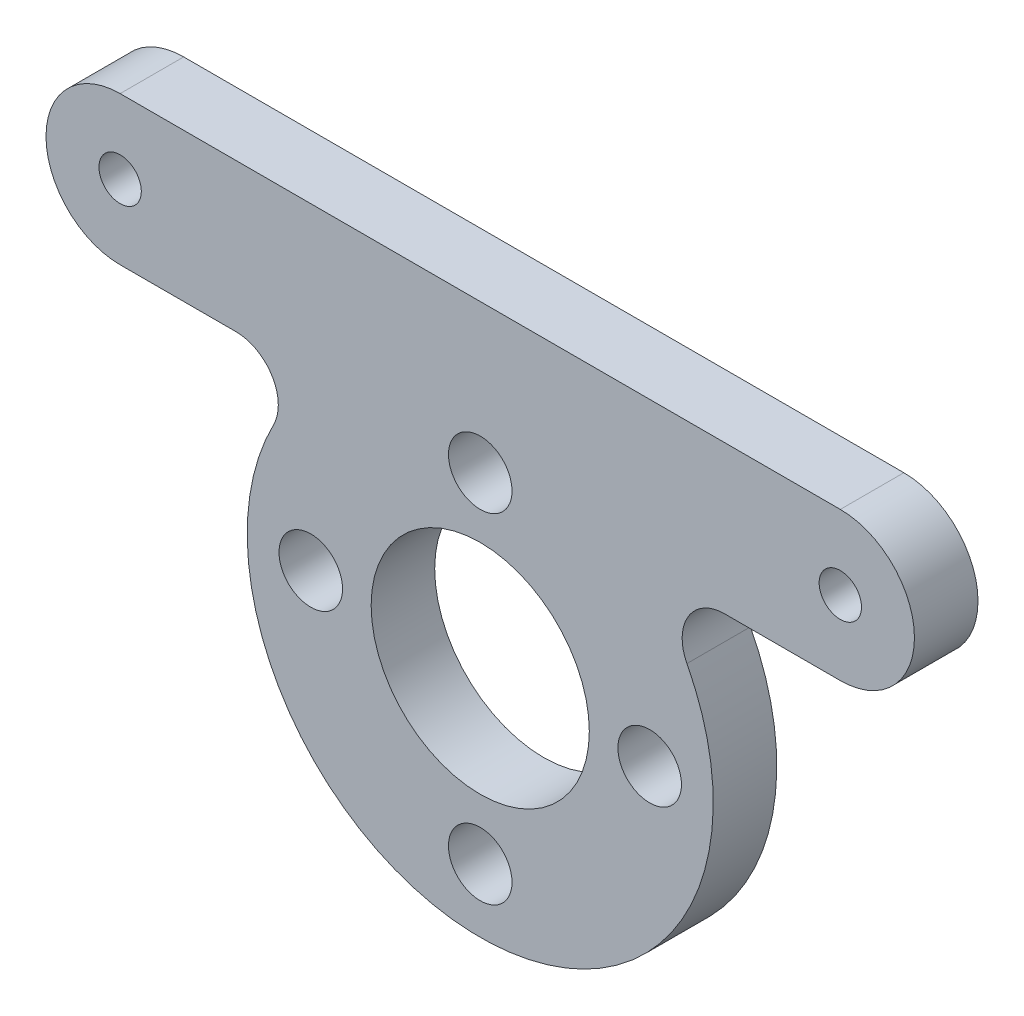
ISO-10303-21;
HEADER;
FILE_DESCRIPTION(('STEP AP214'),'2;1');
FILE_NAME('part.step','',(''),(''),'','','');
FILE_SCHEMA(('AUTOMOTIVE_DESIGN { 1 0 10303 214 1 1 1 1 }'));
ENDSEC;
DATA;
#1=APPLICATION_CONTEXT('core data for automotive mechanical design processes');
#2=APPLICATION_PROTOCOL_DEFINITION('international standard','automotive_design',2000,#1);
#3=PRODUCT_CONTEXT('',#1,'mechanical');
#4=PRODUCT('Part','Part','',(#3));
#5=PRODUCT_RELATED_PRODUCT_CATEGORY('part','',(#4));
#6=PRODUCT_DEFINITION_FORMATION('','',#4);
#7=PRODUCT_DEFINITION_CONTEXT('part definition',#1,'design');
#8=PRODUCT_DEFINITION('design','',#6,#7);
#9=PRODUCT_DEFINITION_SHAPE('','',#8);
#10=(LENGTH_UNIT() NAMED_UNIT(*) SI_UNIT(.MILLI.,.METRE.));
#11=(NAMED_UNIT(*) PLANE_ANGLE_UNIT() SI_UNIT($,.RADIAN.));
#12=(NAMED_UNIT(*) SI_UNIT($,.STERADIAN.) SOLID_ANGLE_UNIT());
#13=UNCERTAINTY_MEASURE_WITH_UNIT(LENGTH_MEASURE(1.E-05),#10,'distance_accuracy_value','');
#14=(GEOMETRIC_REPRESENTATION_CONTEXT(3) GLOBAL_UNCERTAINTY_ASSIGNED_CONTEXT((#13)) GLOBAL_UNIT_ASSIGNED_CONTEXT((#10,
#11,#12)) REPRESENTATION_CONTEXT('',''));
#15=CARTESIAN_POINT('',(0.,0.,0.));
#16=DIRECTION('',(0.,0.,1.));
#17=DIRECTION('',(1.,0.,0.));
#18=AXIS2_PLACEMENT_3D('',#15,#16,#17);
#19=CARTESIAN_POINT('',(0.,0.,3.));
#20=DIRECTION('',(0.,0.,-1.));
#21=DIRECTION('',(-1.,0.,0.));
#22=AXIS2_PLACEMENT_3D('',#19,#20,#21);
#23=CYLINDRICAL_SURFACE('',#22,11.);
#24=CARTESIAN_POINT('',(0.,0.,0.));
#25=DIRECTION('',(0.,0.,1.));
#26=DIRECTION('',(1.,0.,0.));
#27=AXIS2_PLACEMENT_3D('',#24,#25,#26);
#28=CIRCLE('',#27,11.);
#29=CARTESIAN_POINT('',(-9.75832219549067,5.07692307692308,0.));
#30=VERTEX_POINT('',#29);
#31=CARTESIAN_POINT('',(9.75832219549067,5.07692307692308,0.));
#32=VERTEX_POINT('',#31);
#33=EDGE_CURVE('E140',#30,#32,#28,.T.);
#34=ORIENTED_EDGE('',*,*,#33,.T.);
#35=DIRECTION('',(0.,0.,-1.));
#36=VECTOR('',#35,1.);
#37=CARTESIAN_POINT('',(9.75832219549067,5.07692307692308,3.));
#38=LINE('',#37,#36);
#39=CARTESIAN_POINT('',(9.75832219549067,5.07692307692308,3.));
#40=VERTEX_POINT('',#39);
#41=EDGE_CURVE('E163',#32,#40,#38,.F.);
#42=ORIENTED_EDGE('',*,*,#41,.T.);
#43=CARTESIAN_POINT('',(0.,0.,3.));
#44=DIRECTION('',(0.,0.,1.));
#45=DIRECTION('',(1.,0.,0.));
#46=AXIS2_PLACEMENT_3D('',#43,#44,#45);
#47=CIRCLE('',#46,11.);
#48=CARTESIAN_POINT('',(-9.75832219549067,5.07692307692308,3.));
#49=VERTEX_POINT('',#48);
#50=EDGE_CURVE('E115',#49,#40,#47,.T.);
#51=ORIENTED_EDGE('',*,*,#50,.F.);
#52=DIRECTION('',(0.,0.,-1.));
#53=VECTOR('',#52,1.);
#54=CARTESIAN_POINT('',(-9.75832219549067,5.07692307692308,3.));
#55=LINE('',#54,#53);
#56=EDGE_CURVE('E160',#49,#30,#55,.T.);
#57=ORIENTED_EDGE('',*,*,#56,.T.);
#58=EDGE_LOOP('',(#34,#42,#51,#57));
#59=FACE_BOUND('',#58,.T.);
#60=ADVANCED_FACE('F39',(#59),#23,.T.);
#61=CARTESIAN_POINT('',(17.,8.,3.));
#62=DIRECTION('',(0.,1.,0.));
#63=DIRECTION('',(-1.,0.,0.));
#64=AXIS2_PLACEMENT_3D('',#61,#62,#63);
#65=PLANE('',#64);
#66=DIRECTION('',(1.,0.,0.));
#67=VECTOR('',#66,1.);
#68=CARTESIAN_POINT('',(17.,8.,3.));
#69=LINE('',#68,#67);
#70=CARTESIAN_POINT('',(11.5325625946708,8.,3.));
#71=VERTEX_POINT('',#70);
#72=CARTESIAN_POINT('',(17.,8.,3.));
#73=VERTEX_POINT('',#72);
#74=EDGE_CURVE('E103',#71,#73,#69,.T.);
#75=ORIENTED_EDGE('',*,*,#74,.F.);
#76=DIRECTION('',(0.,0.,1.));
#77=VECTOR('',#76,1.);
#78=CARTESIAN_POINT('',(11.5325625946708,8.,0.));
#79=LINE('',#78,#77);
#80=CARTESIAN_POINT('',(11.5325625946708,8.,0.));
#81=VERTEX_POINT('',#80);
#82=EDGE_CURVE('E124',#71,#81,#79,.F.);
#83=ORIENTED_EDGE('',*,*,#82,.T.);
#84=DIRECTION('',(1.,0.,0.));
#85=VECTOR('',#84,1.);
#86=CARTESIAN_POINT('',(17.,8.,0.));
#87=LINE('',#86,#85);
#88=CARTESIAN_POINT('',(17.,8.,0.));
#89=VERTEX_POINT('',#88);
#90=EDGE_CURVE('E121',#81,#89,#87,.T.);
#91=ORIENTED_EDGE('',*,*,#90,.T.);
#92=DIRECTION('',(0.,0.,-1.));
#93=VECTOR('',#92,1.);
#94=CARTESIAN_POINT('',(17.,8.,3.));
#95=LINE('',#94,#93);
#96=EDGE_CURVE('E118',#73,#89,#95,.T.);
#97=ORIENTED_EDGE('',*,*,#96,.F.);
#98=EDGE_LOOP('',(#75,#83,#91,#97));
#99=FACE_BOUND('',#98,.T.);
#100=ADVANCED_FACE('F119',(#99),#65,.F.);
#101=CARTESIAN_POINT('',(17.,11.5,3.));
#102=DIRECTION('',(0.,0.,-1.));
#103=DIRECTION('',(-1.,0.,0.));
#104=AXIS2_PLACEMENT_3D('',#101,#102,#103);
#105=CYLINDRICAL_SURFACE('',#104,3.5);
#106=CARTESIAN_POINT('',(17.,11.5,0.));
#107=DIRECTION('',(0.,0.,1.));
#108=DIRECTION('',(-1.,0.,0.));
#109=AXIS2_PLACEMENT_3D('',#106,#107,#108);
#110=CIRCLE('',#109,3.5);
#111=CARTESIAN_POINT('',(17.,15.,0.));
#112=VERTEX_POINT('',#111);
#113=EDGE_CURVE('E145',#89,#112,#110,.T.);
#114=ORIENTED_EDGE('',*,*,#113,.T.);
#115=DIRECTION('',(0.,0.,-1.));
#116=VECTOR('',#115,1.);
#117=CARTESIAN_POINT('',(17.,15.,3.));
#118=LINE('',#117,#116);
#119=CARTESIAN_POINT('',(17.,15.,3.));
#120=VERTEX_POINT('',#119);
#121=EDGE_CURVE('E125',#120,#112,#118,.T.);
#122=ORIENTED_EDGE('',*,*,#121,.F.);
#123=CARTESIAN_POINT('',(17.,11.5,3.));
#124=DIRECTION('',(0.,0.,1.));
#125=DIRECTION('',(-1.,0.,0.));
#126=AXIS2_PLACEMENT_3D('',#123,#124,#125);
#127=CIRCLE('',#126,3.5);
#128=EDGE_CURVE('E107',#73,#120,#127,.T.);
#129=ORIENTED_EDGE('',*,*,#128,.F.);
#130=ORIENTED_EDGE('',*,*,#96,.T.);
#131=EDGE_LOOP('',(#114,#122,#129,#130));
#132=FACE_BOUND('',#131,.T.);
#133=ADVANCED_FACE('F127',(#132),#105,.T.);
#134=CARTESIAN_POINT('',(17.,15.,3.));
#135=DIRECTION('',(0.,-1.,0.));
#136=DIRECTION('',(1.,0.,0.));
#137=AXIS2_PLACEMENT_3D('',#134,#135,#136);
#138=PLANE('',#137);
#139=DIRECTION('',(-1.,0.,0.));
#140=VECTOR('',#139,1.);
#141=CARTESIAN_POINT('',(17.,15.,0.));
#142=LINE('',#141,#140);
#143=CARTESIAN_POINT('',(-17.,15.,0.));
#144=VERTEX_POINT('',#143);
#145=EDGE_CURVE('E147',#112,#144,#142,.T.);
#146=ORIENTED_EDGE('',*,*,#145,.T.);
#147=DIRECTION('',(0.,0.,-1.));
#148=VECTOR('',#147,1.);
#149=CARTESIAN_POINT('',(-17.,15.,3.));
#150=LINE('',#149,#148);
#151=CARTESIAN_POINT('',(-17.,15.,3.));
#152=VERTEX_POINT('',#151);
#153=EDGE_CURVE('E155',#152,#144,#150,.T.);
#154=ORIENTED_EDGE('',*,*,#153,.F.);
#155=DIRECTION('',(-1.,0.,0.));
#156=VECTOR('',#155,1.);
#157=CARTESIAN_POINT('',(17.,15.,3.));
#158=LINE('',#157,#156);
#159=EDGE_CURVE('E130',#120,#152,#158,.T.);
#160=ORIENTED_EDGE('',*,*,#159,.F.);
#161=ORIENTED_EDGE('',*,*,#121,.T.);
#162=EDGE_LOOP('',(#146,#154,#160,#161));
#163=FACE_BOUND('',#162,.T.);
#164=ADVANCED_FACE('F194',(#163),#138,.F.);
#165=CARTESIAN_POINT('',(-17.,11.5,3.));
#166=DIRECTION('',(0.,0.,-1.));
#167=DIRECTION('',(-1.,0.,0.));
#168=AXIS2_PLACEMENT_3D('',#165,#166,#167);
#169=CYLINDRICAL_SURFACE('',#168,3.5);
#170=CARTESIAN_POINT('',(-17.,11.5,0.));
#171=DIRECTION('',(0.,0.,1.));
#172=DIRECTION('',(1.,0.,0.));
#173=AXIS2_PLACEMENT_3D('',#170,#171,#172);
#174=CIRCLE('',#173,3.5);
#175=CARTESIAN_POINT('',(-17.,8.,0.));
#176=VERTEX_POINT('',#175);
#177=EDGE_CURVE('E149',#144,#176,#174,.T.);
#178=ORIENTED_EDGE('',*,*,#177,.T.);
#179=DIRECTION('',(0.,0.,-1.));
#180=VECTOR('',#179,1.);
#181=CARTESIAN_POINT('',(-17.,8.,3.));
#182=LINE('',#181,#180);
#183=CARTESIAN_POINT('',(-17.,8.,3.));
#184=VERTEX_POINT('',#183);
#185=EDGE_CURVE('E139',#184,#176,#182,.T.);
#186=ORIENTED_EDGE('',*,*,#185,.F.);
#187=CARTESIAN_POINT('',(-17.,11.5,3.));
#188=DIRECTION('',(0.,0.,1.));
#189=DIRECTION('',(1.,0.,0.));
#190=AXIS2_PLACEMENT_3D('',#187,#188,#189);
#191=CIRCLE('',#190,3.5);
#192=EDGE_CURVE('E132',#152,#184,#191,.T.);
#193=ORIENTED_EDGE('',*,*,#192,.F.);
#194=ORIENTED_EDGE('',*,*,#153,.T.);
#195=EDGE_LOOP('',(#178,#186,#193,#194));
#196=FACE_BOUND('',#195,.T.);
#197=ADVANCED_FACE('F197',(#196),#169,.T.);
#198=CARTESIAN_POINT('',(-17.,8.,3.));
#199=DIRECTION('',(0.,1.,0.));
#200=DIRECTION('',(-1.,0.,0.));
#201=AXIS2_PLACEMENT_3D('',#198,#199,#200);
#202=PLANE('',#201);
#203=DIRECTION('',(1.,0.,0.));
#204=VECTOR('',#203,1.);
#205=CARTESIAN_POINT('',(-17.,8.,0.));
#206=LINE('',#205,#204);
#207=CARTESIAN_POINT('',(-11.5325625946708,8.,0.));
#208=VERTEX_POINT('',#207);
#209=EDGE_CURVE('E151',#176,#208,#206,.T.);
#210=ORIENTED_EDGE('',*,*,#209,.T.);
#211=DIRECTION('',(0.,0.,1.));
#212=VECTOR('',#211,1.);
#213=CARTESIAN_POINT('',(-11.5325625946708,8.,3.));
#214=LINE('',#213,#212);
#215=CARTESIAN_POINT('',(-11.5325625946708,8.,3.));
#216=VERTEX_POINT('',#215);
#217=EDGE_CURVE('E54',#208,#216,#214,.T.);
#218=ORIENTED_EDGE('',*,*,#217,.T.);
#219=DIRECTION('',(1.,0.,0.));
#220=VECTOR('',#219,1.);
#221=CARTESIAN_POINT('',(-17.,8.,3.));
#222=LINE('',#221,#220);
#223=EDGE_CURVE('E137',#184,#216,#222,.T.);
#224=ORIENTED_EDGE('',*,*,#223,.F.);
#225=ORIENTED_EDGE('',*,*,#185,.T.);
#226=EDGE_LOOP('',(#210,#218,#224,#225));
#227=FACE_BOUND('',#226,.T.);
#228=ADVANCED_FACE('F201',(#227),#202,.F.);
#229=CARTESIAN_POINT('',(0.,0.,3.));
#230=DIRECTION('',(0.,0.,1.));
#231=DIRECTION('',(1.,0.,0.));
#232=AXIS2_PLACEMENT_3D('',#229,#230,#231);
#233=PLANE('',#232);
#234=CARTESIAN_POINT('',(-8.,0.,3.));
#235=DIRECTION('',(0.,0.,1.));
#236=DIRECTION('',(1.,0.,0.));
#237=AXIS2_PLACEMENT_3D('',#234,#235,#236);
#238=CIRCLE('',#237,1.5);
#239=CARTESIAN_POINT('',(-6.5,0.,3.));
#240=VERTEX_POINT('',#239);
#241=EDGE_CURVE('E245',#240,#240,#238,.T.);
#242=ORIENTED_EDGE('',*,*,#241,.F.);
#243=EDGE_LOOP('',(#242));
#244=FACE_BOUND('',#243,.T.);
#245=CARTESIAN_POINT('',(0.,-8.,3.));
#246=DIRECTION('',(0.,0.,1.));
#247=DIRECTION('',(1.,0.,0.));
#248=AXIS2_PLACEMENT_3D('',#245,#246,#247);
#249=CIRCLE('',#248,1.5);
#250=CARTESIAN_POINT('',(1.49999999999997,-8.,3.));
#251=VERTEX_POINT('',#250);
#252=EDGE_CURVE('E253',#251,#251,#249,.T.);
#253=ORIENTED_EDGE('',*,*,#252,.F.);
#254=EDGE_LOOP('',(#253));
#255=FACE_BOUND('',#254,.T.);
#256=CARTESIAN_POINT('',(-17.,11.5,3.));
#257=DIRECTION('',(0.,0.,1.));
#258=DIRECTION('',(1.,0.,0.));
#259=AXIS2_PLACEMENT_3D('',#256,#257,#258);
#260=CIRCLE('',#259,1.);
#261=CARTESIAN_POINT('',(-16.,11.5,3.));
#262=VERTEX_POINT('',#261);
#263=EDGE_CURVE('E260',#262,#262,#260,.T.);
#264=ORIENTED_EDGE('',*,*,#263,.F.);
#265=EDGE_LOOP('',(#264));
#266=FACE_BOUND('',#265,.T.);
#267=CARTESIAN_POINT('',(8.,0.,3.));
#268=DIRECTION('',(0.,0.,1.));
#269=DIRECTION('',(1.,0.,0.));
#270=AXIS2_PLACEMENT_3D('',#267,#268,#269);
#271=CIRCLE('',#270,1.5);
#272=CARTESIAN_POINT('',(9.5,0.,3.));
#273=VERTEX_POINT('',#272);
#274=EDGE_CURVE('E265',#273,#273,#271,.T.);
#275=ORIENTED_EDGE('',*,*,#274,.F.);
#276=EDGE_LOOP('',(#275));
#277=FACE_BOUND('',#276,.T.);
#278=CARTESIAN_POINT('',(0.,8.,3.));
#279=DIRECTION('',(0.,0.,1.));
#280=DIRECTION('',(1.,0.,0.));
#281=AXIS2_PLACEMENT_3D('',#278,#279,#280);
#282=CIRCLE('',#281,1.5);
#283=CARTESIAN_POINT('',(1.50000000000008,8.,3.));
#284=VERTEX_POINT('',#283);
#285=EDGE_CURVE('E241',#284,#284,#282,.T.);
#286=ORIENTED_EDGE('',*,*,#285,.F.);
#287=EDGE_LOOP('',(#286));
#288=FACE_BOUND('',#287,.T.);
#289=CARTESIAN_POINT('',(17.,11.5,3.));
#290=DIRECTION('',(0.,0.,1.));
#291=DIRECTION('',(1.,0.,0.));
#292=AXIS2_PLACEMENT_3D('',#289,#290,#291);
#293=CIRCLE('',#292,1.);
#294=CARTESIAN_POINT('',(18.,11.5,3.));
#295=VERTEX_POINT('',#294);
#296=EDGE_CURVE('E248',#295,#295,#293,.T.);
#297=ORIENTED_EDGE('',*,*,#296,.F.);
#298=EDGE_LOOP('',(#297));
#299=FACE_BOUND('',#298,.T.);
#300=CARTESIAN_POINT('',(0.,0.,3.));
#301=DIRECTION('',(0.,0.,1.));
#302=DIRECTION('',(1.,0.,0.));
#303=AXIS2_PLACEMENT_3D('',#300,#301,#302);
#304=CIRCLE('',#303,5.15);
#305=CARTESIAN_POINT('',(5.15,0.,3.));
#306=VERTEX_POINT('',#305);
#307=EDGE_CURVE('E272',#306,#306,#304,.T.);
#308=ORIENTED_EDGE('',*,*,#307,.F.);
#309=EDGE_LOOP('',(#308));
#310=FACE_BOUND('',#309,.T.);
#311=ORIENTED_EDGE('',*,*,#223,.T.);
#312=CARTESIAN_POINT('',(-11.5325625946708,6.,3.));
#313=DIRECTION('',(0.,0.,1.));
#314=DIRECTION('',(1.,0.,0.));
#315=AXIS2_PLACEMENT_3D('',#312,#313,#314);
#316=CIRCLE('',#315,2.);
#317=EDGE_CURVE('E11',#216,#49,#316,.F.);
#318=ORIENTED_EDGE('',*,*,#317,.T.);
#319=ORIENTED_EDGE('',*,*,#50,.T.);
#320=CARTESIAN_POINT('',(11.5325625946708,6.,3.));
#321=DIRECTION('',(0.,0.,1.));
#322=DIRECTION('',(1.,0.,0.));
#323=AXIS2_PLACEMENT_3D('',#320,#321,#322);
#324=CIRCLE('',#323,2.);
#325=EDGE_CURVE('E111',#40,#71,#324,.F.);
#326=ORIENTED_EDGE('',*,*,#325,.T.);
#327=ORIENTED_EDGE('',*,*,#74,.T.);
#328=ORIENTED_EDGE('',*,*,#128,.T.);
#329=ORIENTED_EDGE('',*,*,#159,.T.);
#330=ORIENTED_EDGE('',*,*,#192,.T.);
#331=EDGE_LOOP('',(#311,#318,#319,#326,#327,#328,#329,#330));
#332=FACE_BOUND('',#331,.T.);
#333=ADVANCED_FACE('F105',(#244,#255,#266,#277,#288,#299,#310,#332),#233,.T.);
#334=CARTESIAN_POINT('',(0.,0.,0.));
#335=DIRECTION('',(0.,0.,1.));
#336=DIRECTION('',(1.,0.,0.));
#337=AXIS2_PLACEMENT_3D('',#334,#335,#336);
#338=PLANE('',#337);
#339=CARTESIAN_POINT('',(-8.,0.,0.));
#340=DIRECTION('',(0.,0.,1.));
#341=DIRECTION('',(1.,0.,0.));
#342=AXIS2_PLACEMENT_3D('',#339,#340,#341);
#343=CIRCLE('',#342,1.5);
#344=CARTESIAN_POINT('',(-6.5,0.,0.));
#345=VERTEX_POINT('',#344);
#346=EDGE_CURVE('E257',#345,#345,#343,.F.);
#347=ORIENTED_EDGE('',*,*,#346,.F.);
#348=EDGE_LOOP('',(#347));
#349=FACE_BOUND('',#348,.T.);
#350=CARTESIAN_POINT('',(0.,-8.,0.));
#351=DIRECTION('',(0.,0.,1.));
#352=DIRECTION('',(1.,0.,0.));
#353=AXIS2_PLACEMENT_3D('',#350,#351,#352);
#354=CIRCLE('',#353,1.5);
#355=CARTESIAN_POINT('',(1.49999999999997,-8.,0.));
#356=VERTEX_POINT('',#355);
#357=EDGE_CURVE('E256',#356,#356,#354,.F.);
#358=ORIENTED_EDGE('',*,*,#357,.F.);
#359=EDGE_LOOP('',(#358));
#360=FACE_BOUND('',#359,.T.);
#361=CARTESIAN_POINT('',(-17.,11.5,0.));
#362=DIRECTION('',(0.,0.,1.));
#363=DIRECTION('',(1.,0.,0.));
#364=AXIS2_PLACEMENT_3D('',#361,#362,#363);
#365=CIRCLE('',#364,1.);
#366=CARTESIAN_POINT('',(-16.,11.5,0.));
#367=VERTEX_POINT('',#366);
#368=EDGE_CURVE('E269',#367,#367,#365,.F.);
#369=ORIENTED_EDGE('',*,*,#368,.F.);
#370=EDGE_LOOP('',(#369));
#371=FACE_BOUND('',#370,.T.);
#372=CARTESIAN_POINT('',(8.,0.,0.));
#373=DIRECTION('',(0.,0.,1.));
#374=DIRECTION('',(1.,0.,0.));
#375=AXIS2_PLACEMENT_3D('',#372,#373,#374);
#376=CIRCLE('',#375,1.5);
#377=CARTESIAN_POINT('',(9.5,0.,0.));
#378=VERTEX_POINT('',#377);
#379=EDGE_CURVE('E268',#378,#378,#376,.F.);
#380=ORIENTED_EDGE('',*,*,#379,.F.);
#381=EDGE_LOOP('',(#380));
#382=FACE_BOUND('',#381,.T.);
#383=CARTESIAN_POINT('',(0.,8.,0.));
#384=DIRECTION('',(0.,0.,1.));
#385=DIRECTION('',(1.,0.,0.));
#386=AXIS2_PLACEMENT_3D('',#383,#384,#385);
#387=CIRCLE('',#386,1.5);
#388=CARTESIAN_POINT('',(1.50000000000008,8.,0.));
#389=VERTEX_POINT('',#388);
#390=EDGE_CURVE('E238',#389,#389,#387,.F.);
#391=ORIENTED_EDGE('',*,*,#390,.F.);
#392=EDGE_LOOP('',(#391));
#393=FACE_BOUND('',#392,.T.);
#394=CARTESIAN_POINT('',(17.,11.5,0.));
#395=DIRECTION('',(0.,0.,1.));
#396=DIRECTION('',(1.,0.,0.));
#397=AXIS2_PLACEMENT_3D('',#394,#395,#396);
#398=CIRCLE('',#397,1.);
#399=CARTESIAN_POINT('',(18.,11.5,0.));
#400=VERTEX_POINT('',#399);
#401=EDGE_CURVE('E243',#400,#400,#398,.F.);
#402=ORIENTED_EDGE('',*,*,#401,.F.);
#403=EDGE_LOOP('',(#402));
#404=FACE_BOUND('',#403,.T.);
#405=CARTESIAN_POINT('',(0.,0.,0.));
#406=DIRECTION('',(0.,0.,1.));
#407=DIRECTION('',(1.,0.,0.));
#408=AXIS2_PLACEMENT_3D('',#405,#406,#407);
#409=CIRCLE('',#408,5.15);
#410=CARTESIAN_POINT('',(5.15,0.,0.));
#411=VERTEX_POINT('',#410);
#412=EDGE_CURVE('E143',#411,#411,#409,.F.);
#413=ORIENTED_EDGE('',*,*,#412,.F.);
#414=EDGE_LOOP('',(#413));
#415=FACE_BOUND('',#414,.T.);
#416=ORIENTED_EDGE('',*,*,#33,.F.);
#417=CARTESIAN_POINT('',(-11.5325625946708,6.,0.));
#418=DIRECTION('',(0.,0.,1.));
#419=DIRECTION('',(1.,0.,0.));
#420=AXIS2_PLACEMENT_3D('',#417,#418,#419);
#421=CIRCLE('',#420,2.);
#422=EDGE_CURVE('E47',#30,#208,#421,.T.);
#423=ORIENTED_EDGE('',*,*,#422,.T.);
#424=ORIENTED_EDGE('',*,*,#209,.F.);
#425=ORIENTED_EDGE('',*,*,#177,.F.);
#426=ORIENTED_EDGE('',*,*,#145,.F.);
#427=ORIENTED_EDGE('',*,*,#113,.F.);
#428=ORIENTED_EDGE('',*,*,#90,.F.);
#429=CARTESIAN_POINT('',(11.5325625946708,6.,0.));
#430=DIRECTION('',(0.,0.,1.));
#431=DIRECTION('',(1.,0.,0.));
#432=AXIS2_PLACEMENT_3D('',#429,#430,#431);
#433=CIRCLE('',#432,2.);
#434=EDGE_CURVE('E166',#81,#32,#433,.T.);
#435=ORIENTED_EDGE('',*,*,#434,.T.);
#436=EDGE_LOOP('',(#416,#423,#424,#425,#426,#427,#428,#435));
#437=FACE_BOUND('',#436,.T.);
#438=ADVANCED_FACE('F168',(#349,#360,#371,#382,#393,#404,#415,#437),#338,.F.);
#439=CARTESIAN_POINT('',(0.,0.,-14.5663996924429));
#440=DIRECTION('',(0.,0.,1.));
#441=DIRECTION('',(1.,0.,0.));
#442=AXIS2_PLACEMENT_3D('',#439,#440,#441);
#443=CYLINDRICAL_SURFACE('',#442,5.15);
#444=ORIENTED_EDGE('',*,*,#412,.T.);
#445=EDGE_LOOP('',(#444));
#446=FACE_BOUND('',#445,.T.);
#447=ORIENTED_EDGE('',*,*,#307,.T.);
#448=EDGE_LOOP('',(#447));
#449=FACE_BOUND('',#448,.T.);
#450=ADVANCED_FACE('F207',(#446,#449),#443,.F.);
#451=CARTESIAN_POINT('',(17.,11.5,-14.5663996924429));
#452=DIRECTION('',(0.,0.,1.));
#453=DIRECTION('',(1.,0.,0.));
#454=AXIS2_PLACEMENT_3D('',#451,#452,#453);
#455=CYLINDRICAL_SURFACE('',#454,1.);
#456=ORIENTED_EDGE('',*,*,#401,.T.);
#457=EDGE_LOOP('',(#456));
#458=FACE_BOUND('',#457,.T.);
#459=ORIENTED_EDGE('',*,*,#296,.T.);
#460=EDGE_LOOP('',(#459));
#461=FACE_BOUND('',#460,.T.);
#462=ADVANCED_FACE('F214',(#458,#461),#455,.F.);
#463=CARTESIAN_POINT('',(0.,8.,-14.5663996924429));
#464=DIRECTION('',(0.,0.,1.));
#465=DIRECTION('',(1.,0.,0.));
#466=AXIS2_PLACEMENT_3D('',#463,#464,#465);
#467=CYLINDRICAL_SURFACE('',#466,1.5);
#468=ORIENTED_EDGE('',*,*,#390,.T.);
#469=EDGE_LOOP('',(#468));
#470=FACE_BOUND('',#469,.T.);
#471=ORIENTED_EDGE('',*,*,#285,.T.);
#472=EDGE_LOOP('',(#471));
#473=FACE_BOUND('',#472,.T.);
#474=ADVANCED_FACE('F222',(#470,#473),#467,.F.);
#475=CARTESIAN_POINT('',(8.,0.,-14.5663996924429));
#476=DIRECTION('',(0.,0.,1.));
#477=DIRECTION('',(1.,0.,0.));
#478=AXIS2_PLACEMENT_3D('',#475,#476,#477);
#479=CYLINDRICAL_SURFACE('',#478,1.5);
#480=ORIENTED_EDGE('',*,*,#379,.T.);
#481=EDGE_LOOP('',(#480));
#482=FACE_BOUND('',#481,.T.);
#483=ORIENTED_EDGE('',*,*,#274,.T.);
#484=EDGE_LOOP('',(#483));
#485=FACE_BOUND('',#484,.T.);
#486=ADVANCED_FACE('F219',(#482,#485),#479,.F.);
#487=CARTESIAN_POINT('',(-17.,11.5,-14.5663996924429));
#488=DIRECTION('',(0.,0.,1.));
#489=DIRECTION('',(1.,0.,0.));
#490=AXIS2_PLACEMENT_3D('',#487,#488,#489);
#491=CYLINDRICAL_SURFACE('',#490,1.);
#492=ORIENTED_EDGE('',*,*,#368,.T.);
#493=EDGE_LOOP('',(#492));
#494=FACE_BOUND('',#493,.T.);
#495=ORIENTED_EDGE('',*,*,#263,.T.);
#496=EDGE_LOOP('',(#495));
#497=FACE_BOUND('',#496,.T.);
#498=ADVANCED_FACE('F216',(#494,#497),#491,.F.);
#499=CARTESIAN_POINT('',(0.,-8.,-14.5663996924429));
#500=DIRECTION('',(0.,0.,1.));
#501=DIRECTION('',(1.,0.,0.));
#502=AXIS2_PLACEMENT_3D('',#499,#500,#501);
#503=CYLINDRICAL_SURFACE('',#502,1.5);
#504=ORIENTED_EDGE('',*,*,#357,.T.);
#505=EDGE_LOOP('',(#504));
#506=FACE_BOUND('',#505,.T.);
#507=ORIENTED_EDGE('',*,*,#252,.T.);
#508=EDGE_LOOP('',(#507));
#509=FACE_BOUND('',#508,.T.);
#510=ADVANCED_FACE('F182',(#506,#509),#503,.F.);
#511=CARTESIAN_POINT('',(-8.,0.,-14.5663996924429));
#512=DIRECTION('',(0.,0.,1.));
#513=DIRECTION('',(1.,0.,0.));
#514=AXIS2_PLACEMENT_3D('',#511,#512,#513);
#515=CYLINDRICAL_SURFACE('',#514,1.5);
#516=ORIENTED_EDGE('',*,*,#346,.T.);
#517=EDGE_LOOP('',(#516));
#518=FACE_BOUND('',#517,.T.);
#519=ORIENTED_EDGE('',*,*,#241,.T.);
#520=EDGE_LOOP('',(#519));
#521=FACE_BOUND('',#520,.T.);
#522=ADVANCED_FACE('F176',(#518,#521),#515,.F.);
#523=CARTESIAN_POINT('',(11.5325625946708,6.,3.));
#524=DIRECTION('',(0.,0.,-1.));
#525=DIRECTION('',(-1.,0.,0.));
#526=AXIS2_PLACEMENT_3D('',#523,#524,#525);
#527=CYLINDRICAL_SURFACE('',#526,2.);
#528=ORIENTED_EDGE('',*,*,#325,.F.);
#529=ORIENTED_EDGE('',*,*,#41,.F.);
#530=ORIENTED_EDGE('',*,*,#434,.F.);
#531=ORIENTED_EDGE('',*,*,#82,.F.);
#532=EDGE_LOOP('',(#528,#529,#530,#531));
#533=FACE_BOUND('',#532,.T.);
#534=ADVANCED_FACE('F174',(#533),#527,.F.);
#535=CARTESIAN_POINT('',(-11.5325625946708,6.,3.));
#536=DIRECTION('',(0.,0.,-1.));
#537=DIRECTION('',(-1.,0.,0.));
#538=AXIS2_PLACEMENT_3D('',#535,#536,#537);
#539=CYLINDRICAL_SURFACE('',#538,2.);
#540=ORIENTED_EDGE('',*,*,#317,.F.);
#541=ORIENTED_EDGE('',*,*,#217,.F.);
#542=ORIENTED_EDGE('',*,*,#422,.F.);
#543=ORIENTED_EDGE('',*,*,#56,.F.);
#544=EDGE_LOOP('',(#540,#541,#542,#543));
#545=FACE_BOUND('',#544,.T.);
#546=ADVANCED_FACE('F41',(#545),#539,.F.);
#547=CLOSED_SHELL('',(#60,#100,#133,#164,#197,#228,#333,#438,#450,#462,#474,#486,#498,#510,#522,
#534,#546));
#548=MANIFOLD_SOLID_BREP('B2',#547);
#549=ADVANCED_BREP_SHAPE_REPRESENTATION('',(#18,#548),#14);
#550=SHAPE_DEFINITION_REPRESENTATION(#9,#549);
ENDSEC;
END-ISO-10303-21;
